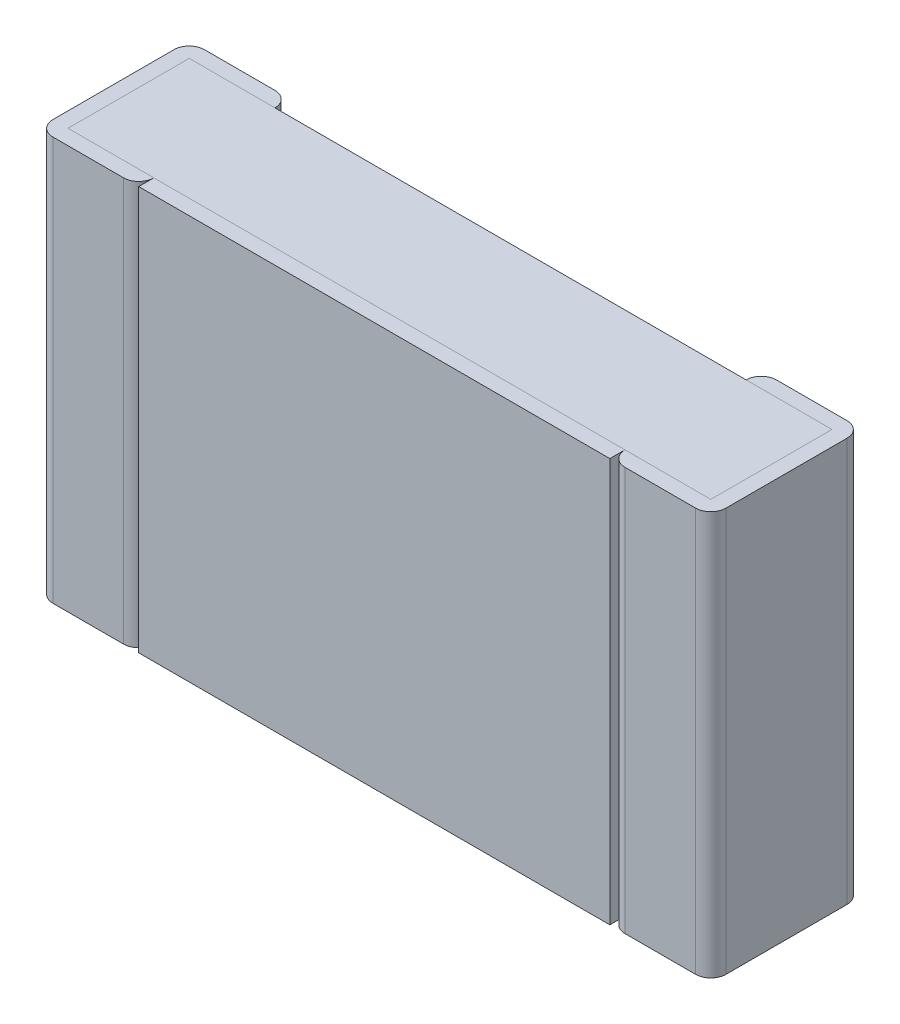
ISO-10303-21;
HEADER;
FILE_DESCRIPTION(('STEP AP214'),'2;1');
FILE_NAME('part.step','',(''),(''),'','','');
FILE_SCHEMA(('AUTOMOTIVE_DESIGN { 1 0 10303 214 1 1 1 1 }'));
ENDSEC;
DATA;
#1=APPLICATION_CONTEXT('core data for automotive mechanical design processes');
#2=APPLICATION_PROTOCOL_DEFINITION('international standard','automotive_design',2000,#1);
#3=PRODUCT_CONTEXT('',#1,'mechanical');
#4=PRODUCT('Part','Part','',(#3));
#5=PRODUCT_RELATED_PRODUCT_CATEGORY('part','',(#4));
#6=PRODUCT_DEFINITION_FORMATION('','',#4);
#7=PRODUCT_DEFINITION_CONTEXT('part definition',#1,'design');
#8=PRODUCT_DEFINITION('design','',#6,#7);
#9=PRODUCT_DEFINITION_SHAPE('','',#8);
#10=(LENGTH_UNIT() NAMED_UNIT(*) SI_UNIT(.MILLI.,.METRE.));
#11=(NAMED_UNIT(*) PLANE_ANGLE_UNIT() SI_UNIT($,.RADIAN.));
#12=(NAMED_UNIT(*) SI_UNIT($,.STERADIAN.) SOLID_ANGLE_UNIT());
#13=UNCERTAINTY_MEASURE_WITH_UNIT(LENGTH_MEASURE(1.E-05),#10,'distance_accuracy_value','');
#14=(GEOMETRIC_REPRESENTATION_CONTEXT(3) GLOBAL_UNCERTAINTY_ASSIGNED_CONTEXT((#13)) GLOBAL_UNIT_ASSIGNED_CONTEXT((#10,
#11,#12)) REPRESENTATION_CONTEXT('',''));
#15=CARTESIAN_POINT('',(0.,0.,0.));
#16=DIRECTION('',(0.,0.,1.));
#17=DIRECTION('',(1.,0.,0.));
#18=AXIS2_PLACEMENT_3D('',#15,#16,#17);
#19=CARTESIAN_POINT('',(-1.,-0.6,0.));
#20=DIRECTION('',(1.,0.,0.));
#21=DIRECTION('',(0.,1.,0.));
#22=AXIS2_PLACEMENT_3D('',#19,#20,#21);
#23=PLANE('',#22);
#24=DIRECTION('',(0.,1.,0.));
#25=VECTOR('',#24,1.);
#26=CARTESIAN_POINT('',(-1.,-0.6,0.405));
#27=LINE('',#26,#25);
#28=CARTESIAN_POINT('',(-1.,-0.6,0.405));
#29=VERTEX_POINT('',#28);
#30=CARTESIAN_POINT('',(-1.,0.6,0.405));
#31=VERTEX_POINT('',#30);
#32=EDGE_CURVE('E11',#29,#31,#27,.T.);
#33=ORIENTED_EDGE('',*,*,#32,.T.);
#34=DIRECTION('',(0.,0.,1.));
#35=VECTOR('',#34,1.);
#36=CARTESIAN_POINT('',(-1.,0.6,0.));
#37=LINE('',#36,#35);
#38=CARTESIAN_POINT('',(-1.,0.6,0.045));
#39=VERTEX_POINT('',#38);
#40=EDGE_CURVE('E41',#39,#31,#37,.T.);
#41=ORIENTED_EDGE('',*,*,#40,.F.);
#42=DIRECTION('',(0.,1.,0.));
#43=VECTOR('',#42,1.);
#44=CARTESIAN_POINT('',(-1.,-0.6,0.045));
#45=LINE('',#44,#43);
#46=CARTESIAN_POINT('',(-1.,-0.6,0.045));
#47=VERTEX_POINT('',#46);
#48=EDGE_CURVE('E310',#47,#39,#45,.T.);
#49=ORIENTED_EDGE('',*,*,#48,.F.);
#50=DIRECTION('',(0.,0.,1.));
#51=VECTOR('',#50,1.);
#52=CARTESIAN_POINT('',(-1.,-0.6,0.));
#53=LINE('',#52,#51);
#54=EDGE_CURVE('E27',#47,#29,#53,.T.);
#55=ORIENTED_EDGE('',*,*,#54,.T.);
#56=EDGE_LOOP('',(#33,#41,#49,#55));
#57=FACE_BOUND('',#56,.T.);
#58=ADVANCED_FACE('F16',(#57),#23,.F.);
#59=CARTESIAN_POINT('',(-1.,-0.6,0.));
#60=DIRECTION('',(0.,1.,0.));
#61=DIRECTION('',(1.,0.,0.));
#62=AXIS2_PLACEMENT_3D('',#59,#60,#61);
#63=PLANE('',#62);
#64=CARTESIAN_POINT('',(-0.745,-0.6,0.045));
#65=DIRECTION('',(0.,1.,0.));
#66=DIRECTION('',(0.,0.,1.));
#67=AXIS2_PLACEMENT_3D('',#64,#65,#66);
#68=CIRCLE('',#67,0.045);
#69=CARTESIAN_POINT('',(-0.7,-0.6,0.045));
#70=VERTEX_POINT('',#69);
#71=CARTESIAN_POINT('',(-0.745,-0.6,0.));
#72=VERTEX_POINT('',#71);
#73=EDGE_CURVE('E342',#70,#72,#68,.T.);
#74=ORIENTED_EDGE('',*,*,#73,.F.);
#75=DIRECTION('',(1.,0.,0.));
#76=VECTOR('',#75,1.);
#77=CARTESIAN_POINT('',(-0.955,-0.6,0.045));
#78=LINE('',#77,#76);
#79=CARTESIAN_POINT('',(-0.955,-0.6,0.045));
#80=VERTEX_POINT('',#79);
#81=EDGE_CURVE('E279',#80,#70,#78,.T.);
#82=ORIENTED_EDGE('',*,*,#81,.F.);
#83=DIRECTION('',(0.,0.,1.));
#84=VECTOR('',#83,1.);
#85=CARTESIAN_POINT('',(-0.955,-0.6,0.045));
#86=LINE('',#85,#84);
#87=CARTESIAN_POINT('',(-0.955,-0.6,0.405));
#88=VERTEX_POINT('',#87);
#89=EDGE_CURVE('E319',#80,#88,#86,.T.);
#90=ORIENTED_EDGE('',*,*,#89,.T.);
#91=DIRECTION('',(1.,0.,0.));
#92=VECTOR('',#91,1.);
#93=CARTESIAN_POINT('',(-0.955,-0.6,0.405));
#94=LINE('',#93,#92);
#95=CARTESIAN_POINT('',(-0.7,-0.6,0.405));
#96=VERTEX_POINT('',#95);
#97=EDGE_CURVE('E381',#88,#96,#94,.T.);
#98=ORIENTED_EDGE('',*,*,#97,.T.);
#99=CARTESIAN_POINT('',(-0.745,-0.6,0.405));
#100=DIRECTION('',(0.,-1.,0.));
#101=DIRECTION('',(0.,0.,1.));
#102=AXIS2_PLACEMENT_3D('',#99,#100,#101);
#103=CIRCLE('',#102,0.045);
#104=CARTESIAN_POINT('',(-0.745,-0.6,0.45));
#105=VERTEX_POINT('',#104);
#106=EDGE_CURVE('E403',#96,#105,#103,.T.);
#107=ORIENTED_EDGE('',*,*,#106,.T.);
#108=DIRECTION('',(1.,0.,0.));
#109=VECTOR('',#108,1.);
#110=CARTESIAN_POINT('',(-1.,-0.6,0.45));
#111=LINE('',#110,#109);
#112=CARTESIAN_POINT('',(-0.955,-0.6,0.45));
#113=VERTEX_POINT('',#112);
#114=EDGE_CURVE('E271',#113,#105,#111,.T.);
#115=ORIENTED_EDGE('',*,*,#114,.F.);
#116=CARTESIAN_POINT('',(-0.955,-0.6,0.405));
#117=DIRECTION('',(0.,1.,0.));
#118=DIRECTION('',(0.,0.,1.));
#119=AXIS2_PLACEMENT_3D('',#116,#117,#118);
#120=CIRCLE('',#119,0.045);
#121=EDGE_CURVE('E311',#29,#113,#120,.T.);
#122=ORIENTED_EDGE('',*,*,#121,.F.);
#123=ORIENTED_EDGE('',*,*,#54,.F.);
#124=CARTESIAN_POINT('',(-0.955,-0.6,0.045));
#125=DIRECTION('',(0.,-1.,0.));
#126=DIRECTION('',(0.,0.,1.));
#127=AXIS2_PLACEMENT_3D('',#124,#125,#126);
#128=CIRCLE('',#127,0.045);
#129=CARTESIAN_POINT('',(-0.955,-0.6,0.));
#130=VERTEX_POINT('',#129);
#131=EDGE_CURVE('E351',#47,#130,#128,.T.);
#132=ORIENTED_EDGE('',*,*,#131,.T.);
#133=DIRECTION('',(1.,0.,0.));
#134=VECTOR('',#133,1.);
#135=CARTESIAN_POINT('',(-1.,-0.6,0.));
#136=LINE('',#135,#134);
#137=EDGE_CURVE('E347',#130,#72,#136,.T.);
#138=ORIENTED_EDGE('',*,*,#137,.T.);
#139=EDGE_LOOP('',(#74,#82,#90,#98,#107,#115,#122,#123,#132,#138));
#140=FACE_BOUND('',#139,.T.);
#141=ADVANCED_FACE('F489',(#140),#63,.F.);
#142=CARTESIAN_POINT('',(-0.955,-0.6,0.045));
#143=DIRECTION('',(0.,1.,0.));
#144=DIRECTION('',(-1.,0.,0.));
#145=AXIS2_PLACEMENT_3D('',#142,#143,#144);
#146=CYLINDRICAL_SURFACE('',#145,0.045);
#147=ORIENTED_EDGE('',*,*,#48,.T.);
#148=CARTESIAN_POINT('',(-0.955,0.6,0.045));
#149=DIRECTION('',(0.,-1.,0.));
#150=DIRECTION('',(0.,0.,1.));
#151=AXIS2_PLACEMENT_3D('',#148,#149,#150);
#152=CIRCLE('',#151,0.045);
#153=CARTESIAN_POINT('',(-0.955,0.6,0.));
#154=VERTEX_POINT('',#153);
#155=EDGE_CURVE('E306',#39,#154,#152,.T.);
#156=ORIENTED_EDGE('',*,*,#155,.T.);
#157=DIRECTION('',(0.,1.,0.));
#158=VECTOR('',#157,1.);
#159=CARTESIAN_POINT('',(-0.955,-0.6,0.));
#160=LINE('',#159,#158);
#161=EDGE_CURVE('E341',#130,#154,#160,.T.);
#162=ORIENTED_EDGE('',*,*,#161,.F.);
#163=ORIENTED_EDGE('',*,*,#131,.F.);
#164=EDGE_LOOP('',(#147,#156,#162,#163));
#165=FACE_BOUND('',#164,.T.);
#166=ADVANCED_FACE('F474',(#165),#146,.T.);
#167=CARTESIAN_POINT('',(-0.955,-0.6,0.405));
#168=DIRECTION('',(0.,1.,0.));
#169=DIRECTION('',(-1.,0.,0.));
#170=AXIS2_PLACEMENT_3D('',#167,#168,#169);
#171=CYLINDRICAL_SURFACE('',#170,0.045);
#172=ORIENTED_EDGE('',*,*,#121,.T.);
#173=DIRECTION('',(0.,1.,0.));
#174=VECTOR('',#173,1.);
#175=CARTESIAN_POINT('',(-0.955,-0.6,0.45));
#176=LINE('',#175,#174);
#177=CARTESIAN_POINT('',(-0.955,0.6,0.45));
#178=VERTEX_POINT('',#177);
#179=EDGE_CURVE('E376',#113,#178,#176,.T.);
#180=ORIENTED_EDGE('',*,*,#179,.T.);
#181=CARTESIAN_POINT('',(-0.955,0.6,0.405));
#182=DIRECTION('',(0.,1.,0.));
#183=DIRECTION('',(0.,0.,1.));
#184=AXIS2_PLACEMENT_3D('',#181,#182,#183);
#185=CIRCLE('',#184,0.045);
#186=EDGE_CURVE('E262',#31,#178,#185,.T.);
#187=ORIENTED_EDGE('',*,*,#186,.F.);
#188=ORIENTED_EDGE('',*,*,#32,.F.);
#189=EDGE_LOOP('',(#172,#180,#187,#188));
#190=FACE_BOUND('',#189,.T.);
#191=ADVANCED_FACE('F495',(#190),#171,.T.);
#192=CARTESIAN_POINT('',(-1.,0.6,0.));
#193=DIRECTION('',(0.,1.,0.));
#194=DIRECTION('',(1.,0.,0.));
#195=AXIS2_PLACEMENT_3D('',#192,#193,#194);
#196=PLANE('',#195);
#197=DIRECTION('',(1.,0.,0.));
#198=VECTOR('',#197,1.);
#199=CARTESIAN_POINT('',(-1.,0.6,0.));
#200=LINE('',#199,#198);
#201=CARTESIAN_POINT('',(-0.745,0.6,0.));
#202=VERTEX_POINT('',#201);
#203=EDGE_CURVE('E338',#154,#202,#200,.T.);
#204=ORIENTED_EDGE('',*,*,#203,.F.);
#205=ORIENTED_EDGE('',*,*,#155,.F.);
#206=ORIENTED_EDGE('',*,*,#40,.T.);
#207=ORIENTED_EDGE('',*,*,#186,.T.);
#208=DIRECTION('',(1.,0.,0.));
#209=VECTOR('',#208,1.);
#210=CARTESIAN_POINT('',(-1.,0.6,0.45));
#211=LINE('',#210,#209);
#212=CARTESIAN_POINT('',(-0.745,0.6,0.45));
#213=VERTEX_POINT('',#212);
#214=EDGE_CURVE('E258',#178,#213,#211,.T.);
#215=ORIENTED_EDGE('',*,*,#214,.T.);
#216=CARTESIAN_POINT('',(-0.745,0.6,0.405));
#217=DIRECTION('',(0.,-1.,0.));
#218=DIRECTION('',(0.,0.,1.));
#219=AXIS2_PLACEMENT_3D('',#216,#217,#218);
#220=CIRCLE('',#219,0.045);
#221=CARTESIAN_POINT('',(-0.7,0.6,0.405));
#222=VERTEX_POINT('',#221);
#223=EDGE_CURVE('E245',#222,#213,#220,.T.);
#224=ORIENTED_EDGE('',*,*,#223,.F.);
#225=DIRECTION('',(1.,0.,0.));
#226=VECTOR('',#225,1.);
#227=CARTESIAN_POINT('',(-0.955,0.6,0.405));
#228=LINE('',#227,#226);
#229=CARTESIAN_POINT('',(-0.955,0.6,0.405));
#230=VERTEX_POINT('',#229);
#231=EDGE_CURVE('E292',#230,#222,#228,.T.);
#232=ORIENTED_EDGE('',*,*,#231,.F.);
#233=DIRECTION('',(0.,0.,1.));
#234=VECTOR('',#233,1.);
#235=CARTESIAN_POINT('',(-0.955,0.6,0.045));
#236=LINE('',#235,#234);
#237=CARTESIAN_POINT('',(-0.955,0.6,0.045));
#238=VERTEX_POINT('',#237);
#239=EDGE_CURVE('E255',#238,#230,#236,.T.);
#240=ORIENTED_EDGE('',*,*,#239,.F.);
#241=DIRECTION('',(1.,0.,0.));
#242=VECTOR('',#241,1.);
#243=CARTESIAN_POINT('',(-0.955,0.6,0.045));
#244=LINE('',#243,#242);
#245=CARTESIAN_POINT('',(-0.7,0.6,0.045));
#246=VERTEX_POINT('',#245);
#247=EDGE_CURVE('E267',#238,#246,#244,.T.);
#248=ORIENTED_EDGE('',*,*,#247,.T.);
#249=CARTESIAN_POINT('',(-0.745,0.6,0.045));
#250=DIRECTION('',(0.,1.,0.));
#251=DIRECTION('',(0.,0.,1.));
#252=AXIS2_PLACEMENT_3D('',#249,#250,#251);
#253=CIRCLE('',#252,0.045);
#254=EDGE_CURVE('E346',#246,#202,#253,.T.);
#255=ORIENTED_EDGE('',*,*,#254,.T.);
#256=EDGE_LOOP('',(#204,#205,#206,#207,#215,#224,#232,#240,#248,#255));
#257=FACE_BOUND('',#256,.T.);
#258=ADVANCED_FACE('F260',(#257),#196,.T.);
#259=CARTESIAN_POINT('',(-1.,-0.6,0.));
#260=DIRECTION('',(0.,0.,1.));
#261=DIRECTION('',(1.,0.,0.));
#262=AXIS2_PLACEMENT_3D('',#259,#260,#261);
#263=PLANE('',#262);
#264=DIRECTION('',(0.,1.,0.));
#265=VECTOR('',#264,1.);
#266=CARTESIAN_POINT('',(-0.745,-0.6,0.));
#267=LINE('',#266,#265);
#268=EDGE_CURVE('E372',#72,#202,#267,.T.);
#269=ORIENTED_EDGE('',*,*,#268,.F.);
#270=ORIENTED_EDGE('',*,*,#137,.F.);
#271=ORIENTED_EDGE('',*,*,#161,.T.);
#272=ORIENTED_EDGE('',*,*,#203,.T.);
#273=EDGE_LOOP('',(#269,#270,#271,#272));
#274=FACE_BOUND('',#273,.T.);
#275=ADVANCED_FACE('F471',(#274),#263,.F.);
#276=CARTESIAN_POINT('',(-0.745,-0.6,0.045));
#277=DIRECTION('',(0.,1.,0.));
#278=DIRECTION('',(1.,0.,0.));
#279=AXIS2_PLACEMENT_3D('',#276,#277,#278);
#280=CYLINDRICAL_SURFACE('',#279,0.045);
#281=ORIENTED_EDGE('',*,*,#73,.T.);
#282=ORIENTED_EDGE('',*,*,#268,.T.);
#283=ORIENTED_EDGE('',*,*,#254,.F.);
#284=DIRECTION('',(0.,1.,0.));
#285=VECTOR('',#284,1.);
#286=CARTESIAN_POINT('',(-0.7,-0.6,0.045));
#287=LINE('',#286,#285);
#288=EDGE_CURVE('E361',#70,#246,#287,.T.);
#289=ORIENTED_EDGE('',*,*,#288,.F.);
#290=EDGE_LOOP('',(#281,#282,#283,#289));
#291=FACE_BOUND('',#290,.T.);
#292=ADVANCED_FACE('F480',(#291),#280,.T.);
#293=CARTESIAN_POINT('',(-0.955,-0.6,0.045));
#294=DIRECTION('',(0.,1.,0.));
#295=DIRECTION('',(1.,0.,0.));
#296=AXIS2_PLACEMENT_3D('',#293,#294,#295);
#297=PLANE('',#296);
#298=DIRECTION('',(1.,0.,0.));
#299=VECTOR('',#298,1.);
#300=CARTESIAN_POINT('',(-0.955,-0.6,0.045));
#301=LINE('',#300,#299);
#302=CARTESIAN_POINT('',(0.7,-0.6,0.045));
#303=VERTEX_POINT('',#302);
#304=EDGE_CURVE('E323',#70,#303,#301,.T.);
#305=ORIENTED_EDGE('',*,*,#304,.T.);
#306=DIRECTION('',(1.,0.,0.));
#307=VECTOR('',#306,1.);
#308=CARTESIAN_POINT('',(-0.955,-0.6,0.045));
#309=LINE('',#308,#307);
#310=CARTESIAN_POINT('',(0.955,-0.6,0.045));
#311=VERTEX_POINT('',#310);
#312=EDGE_CURVE('E320',#303,#311,#309,.T.);
#313=ORIENTED_EDGE('',*,*,#312,.T.);
#314=DIRECTION('',(0.,0.,1.));
#315=VECTOR('',#314,1.);
#316=CARTESIAN_POINT('',(0.955,-0.6,0.045));
#317=LINE('',#316,#315);
#318=CARTESIAN_POINT('',(0.955,-0.6,0.405));
#319=VERTEX_POINT('',#318);
#320=EDGE_CURVE('E173',#311,#319,#317,.T.);
#321=ORIENTED_EDGE('',*,*,#320,.T.);
#322=DIRECTION('',(1.,0.,0.));
#323=VECTOR('',#322,1.);
#324=CARTESIAN_POINT('',(-0.955,-0.6,0.405));
#325=LINE('',#324,#323);
#326=CARTESIAN_POINT('',(0.7,-0.6,0.405));
#327=VERTEX_POINT('',#326);
#328=EDGE_CURVE('E437',#327,#319,#325,.T.);
#329=ORIENTED_EDGE('',*,*,#328,.F.);
#330=DIRECTION('',(1.,0.,0.));
#331=VECTOR('',#330,1.);
#332=CARTESIAN_POINT('',(-0.7,-0.6,0.405));
#333=LINE('',#332,#331);
#334=EDGE_CURVE('E397',#96,#327,#333,.T.);
#335=ORIENTED_EDGE('',*,*,#334,.F.);
#336=ORIENTED_EDGE('',*,*,#97,.F.);
#337=ORIENTED_EDGE('',*,*,#89,.F.);
#338=ORIENTED_EDGE('',*,*,#81,.T.);
#339=EDGE_LOOP('',(#305,#313,#321,#329,#335,#336,#337,#338));
#340=FACE_BOUND('',#339,.T.);
#341=ADVANCED_FACE('F551',(#340),#297,.F.);
#342=CARTESIAN_POINT('',(-1.,-0.6,0.45));
#343=DIRECTION('',(0.,0.,1.));
#344=DIRECTION('',(1.,0.,0.));
#345=AXIS2_PLACEMENT_3D('',#342,#343,#344);
#346=PLANE('',#345);
#347=ORIENTED_EDGE('',*,*,#214,.F.);
#348=ORIENTED_EDGE('',*,*,#179,.F.);
#349=ORIENTED_EDGE('',*,*,#114,.T.);
#350=DIRECTION('',(0.,1.,0.));
#351=VECTOR('',#350,1.);
#352=CARTESIAN_POINT('',(-0.745,-0.6,0.45));
#353=LINE('',#352,#351);
#354=EDGE_CURVE('E250',#105,#213,#353,.T.);
#355=ORIENTED_EDGE('',*,*,#354,.T.);
#356=EDGE_LOOP('',(#347,#348,#349,#355));
#357=FACE_BOUND('',#356,.T.);
#358=ADVANCED_FACE('F270',(#357),#346,.T.);
#359=CARTESIAN_POINT('',(-0.745,-0.6,0.405));
#360=DIRECTION('',(0.,1.,0.));
#361=DIRECTION('',(1.,0.,0.));
#362=AXIS2_PLACEMENT_3D('',#359,#360,#361);
#363=CYLINDRICAL_SURFACE('',#362,0.045);
#364=DIRECTION('',(0.,1.,0.));
#365=VECTOR('',#364,1.);
#366=CARTESIAN_POINT('',(-0.7,-0.6,0.405));
#367=LINE('',#366,#365);
#368=EDGE_CURVE('E252',#96,#222,#367,.T.);
#369=ORIENTED_EDGE('',*,*,#368,.T.);
#370=ORIENTED_EDGE('',*,*,#223,.T.);
#371=ORIENTED_EDGE('',*,*,#354,.F.);
#372=ORIENTED_EDGE('',*,*,#106,.F.);
#373=EDGE_LOOP('',(#369,#370,#371,#372));
#374=FACE_BOUND('',#373,.T.);
#375=ADVANCED_FACE('F247',(#374),#363,.T.);
#376=CARTESIAN_POINT('',(-0.955,0.6,0.045));
#377=DIRECTION('',(0.,1.,0.));
#378=DIRECTION('',(1.,0.,0.));
#379=AXIS2_PLACEMENT_3D('',#376,#377,#378);
#380=PLANE('',#379);
#381=ORIENTED_EDGE('',*,*,#247,.F.);
#382=ORIENTED_EDGE('',*,*,#239,.T.);
#383=ORIENTED_EDGE('',*,*,#231,.T.);
#384=DIRECTION('',(1.,0.,0.));
#385=VECTOR('',#384,1.);
#386=CARTESIAN_POINT('',(-0.7,0.6,0.405));
#387=LINE('',#386,#385);
#388=CARTESIAN_POINT('',(0.7,0.6,0.405));
#389=VERTEX_POINT('',#388);
#390=EDGE_CURVE('E296',#222,#389,#387,.T.);
#391=ORIENTED_EDGE('',*,*,#390,.T.);
#392=DIRECTION('',(1.,0.,0.));
#393=VECTOR('',#392,1.);
#394=CARTESIAN_POINT('',(-0.955,0.6,0.405));
#395=LINE('',#394,#393);
#396=CARTESIAN_POINT('',(0.955,0.6,0.405));
#397=VERTEX_POINT('',#396);
#398=EDGE_CURVE('E398',#389,#397,#395,.T.);
#399=ORIENTED_EDGE('',*,*,#398,.T.);
#400=DIRECTION('',(0.,0.,1.));
#401=VECTOR('',#400,1.);
#402=CARTESIAN_POINT('',(0.955,0.6,0.045));
#403=LINE('',#402,#401);
#404=CARTESIAN_POINT('',(0.955,0.6,0.045));
#405=VERTEX_POINT('',#404);
#406=EDGE_CURVE('E291',#405,#397,#403,.T.);
#407=ORIENTED_EDGE('',*,*,#406,.F.);
#408=DIRECTION('',(1.,0.,0.));
#409=VECTOR('',#408,1.);
#410=CARTESIAN_POINT('',(-0.955,0.6,0.045));
#411=LINE('',#410,#409);
#412=CARTESIAN_POINT('',(0.7,0.6,0.045));
#413=VERTEX_POINT('',#412);
#414=EDGE_CURVE('E287',#413,#405,#411,.T.);
#415=ORIENTED_EDGE('',*,*,#414,.F.);
#416=DIRECTION('',(1.,0.,0.));
#417=VECTOR('',#416,1.);
#418=CARTESIAN_POINT('',(-0.955,0.6,0.045));
#419=LINE('',#418,#417);
#420=EDGE_CURVE('E364',#246,#413,#419,.T.);
#421=ORIENTED_EDGE('',*,*,#420,.F.);
#422=EDGE_LOOP('',(#381,#382,#383,#391,#399,#407,#415,#421));
#423=FACE_BOUND('',#422,.T.);
#424=ADVANCED_FACE('F523',(#423),#380,.T.);
#425=CARTESIAN_POINT('',(-0.955,-0.6,0.045));
#426=DIRECTION('',(0.,0.,1.));
#427=DIRECTION('',(1.,0.,0.));
#428=AXIS2_PLACEMENT_3D('',#425,#426,#427);
#429=PLANE('',#428);
#430=ORIENTED_EDGE('',*,*,#420,.T.);
#431=DIRECTION('',(0.,1.,0.));
#432=VECTOR('',#431,1.);
#433=CARTESIAN_POINT('',(0.7,-0.6,0.045));
#434=LINE('',#433,#432);
#435=EDGE_CURVE('E312',#303,#413,#434,.T.);
#436=ORIENTED_EDGE('',*,*,#435,.F.);
#437=ORIENTED_EDGE('',*,*,#304,.F.);
#438=ORIENTED_EDGE('',*,*,#288,.T.);
#439=EDGE_LOOP('',(#430,#436,#437,#438));
#440=FACE_BOUND('',#439,.T.);
#441=ADVANCED_FACE('F520',(#440),#429,.F.);
#442=CARTESIAN_POINT('',(0.7,-0.6,0.));
#443=DIRECTION('',(0.,1.,0.));
#444=DIRECTION('',(1.,0.,0.));
#445=AXIS2_PLACEMENT_3D('',#442,#443,#444);
#446=PLANE('',#445);
#447=CARTESIAN_POINT('',(0.955,-0.6,0.045));
#448=DIRECTION('',(0.,1.,0.));
#449=DIRECTION('',(0.,0.,1.));
#450=AXIS2_PLACEMENT_3D('',#447,#448,#449);
#451=CIRCLE('',#450,0.045);
#452=CARTESIAN_POINT('',(1.,-0.6,0.045));
#453=VERTEX_POINT('',#452);
#454=CARTESIAN_POINT('',(0.955,-0.6,0.));
#455=VERTEX_POINT('',#454);
#456=EDGE_CURVE('E419',#453,#455,#451,.T.);
#457=ORIENTED_EDGE('',*,*,#456,.F.);
#458=DIRECTION('',(0.,0.,1.));
#459=VECTOR('',#458,1.);
#460=CARTESIAN_POINT('',(1.,-0.6,0.));
#461=LINE('',#460,#459);
#462=CARTESIAN_POINT('',(1.,-0.6,0.405));
#463=VERTEX_POINT('',#462);
#464=EDGE_CURVE('E365',#453,#463,#461,.T.);
#465=ORIENTED_EDGE('',*,*,#464,.T.);
#466=CARTESIAN_POINT('',(0.955,-0.6,0.405));
#467=DIRECTION('',(0.,-1.,0.));
#468=DIRECTION('',(0.,0.,1.));
#469=AXIS2_PLACEMENT_3D('',#466,#467,#468);
#470=CIRCLE('',#469,0.045);
#471=CARTESIAN_POINT('',(0.955,-0.6,0.45));
#472=VERTEX_POINT('',#471);
#473=EDGE_CURVE('E429',#463,#472,#470,.T.);
#474=ORIENTED_EDGE('',*,*,#473,.T.);
#475=DIRECTION('',(1.,0.,0.));
#476=VECTOR('',#475,1.);
#477=CARTESIAN_POINT('',(0.7,-0.6,0.45));
#478=LINE('',#477,#476);
#479=CARTESIAN_POINT('',(0.745,-0.6,0.45));
#480=VERTEX_POINT('',#479);
#481=EDGE_CURVE('E357',#480,#472,#478,.T.);
#482=ORIENTED_EDGE('',*,*,#481,.F.);
#483=CARTESIAN_POINT('',(0.745,-0.6,0.405));
#484=DIRECTION('',(0.,1.,0.));
#485=DIRECTION('',(0.,0.,1.));
#486=AXIS2_PLACEMENT_3D('',#483,#484,#485);
#487=CIRCLE('',#486,0.045);
#488=EDGE_CURVE('E185',#327,#480,#487,.T.);
#489=ORIENTED_EDGE('',*,*,#488,.F.);
#490=ORIENTED_EDGE('',*,*,#328,.T.);
#491=ORIENTED_EDGE('',*,*,#320,.F.);
#492=ORIENTED_EDGE('',*,*,#312,.F.);
#493=CARTESIAN_POINT('',(0.745,-0.6,0.045));
#494=DIRECTION('',(0.,-1.,0.));
#495=DIRECTION('',(0.,0.,1.));
#496=AXIS2_PLACEMENT_3D('',#493,#494,#495);
#497=CIRCLE('',#496,0.045);
#498=CARTESIAN_POINT('',(0.745,-0.6,0.));
#499=VERTEX_POINT('',#498);
#500=EDGE_CURVE('E433',#303,#499,#497,.T.);
#501=ORIENTED_EDGE('',*,*,#500,.T.);
#502=DIRECTION('',(1.,0.,0.));
#503=VECTOR('',#502,1.);
#504=CARTESIAN_POINT('',(0.7,-0.6,0.));
#505=LINE('',#504,#503);
#506=EDGE_CURVE('E396',#499,#455,#505,.T.);
#507=ORIENTED_EDGE('',*,*,#506,.T.);
#508=EDGE_LOOP('',(#457,#465,#474,#482,#489,#490,#491,#492,#501,#507));
#509=FACE_BOUND('',#508,.T.);
#510=ADVANCED_FACE('F517',(#509),#446,.F.);
#511=CARTESIAN_POINT('',(-0.7,-0.6,0.405));
#512=DIRECTION('',(0.,1.,0.));
#513=DIRECTION('',(1.,0.,0.));
#514=AXIS2_PLACEMENT_3D('',#511,#512,#513);
#515=PLANE('',#514);
#516=DIRECTION('',(0.,0.,1.));
#517=VECTOR('',#516,1.);
#518=CARTESIAN_POINT('',(0.7,-0.6,0.405));
#519=LINE('',#518,#517);
#520=CARTESIAN_POINT('',(0.7,-0.6,0.45));
#521=VERTEX_POINT('',#520);
#522=EDGE_CURVE('E392',#327,#521,#519,.T.);
#523=ORIENTED_EDGE('',*,*,#522,.T.);
#524=DIRECTION('',(1.,0.,0.));
#525=VECTOR('',#524,1.);
#526=CARTESIAN_POINT('',(-0.7,-0.6,0.45));
#527=LINE('',#526,#525);
#528=CARTESIAN_POINT('',(-0.7,-0.6,0.45));
#529=VERTEX_POINT('',#528);
#530=EDGE_CURVE('E20',#529,#521,#527,.T.);
#531=ORIENTED_EDGE('',*,*,#530,.F.);
#532=DIRECTION('',(0.,0.,1.));
#533=VECTOR('',#532,1.);
#534=CARTESIAN_POINT('',(-0.7,-0.6,0.405));
#535=LINE('',#534,#533);
#536=EDGE_CURVE('E290',#96,#529,#535,.T.);
#537=ORIENTED_EDGE('',*,*,#536,.F.);
#538=ORIENTED_EDGE('',*,*,#334,.T.);
#539=EDGE_LOOP('',(#523,#531,#537,#538));
#540=FACE_BOUND('',#539,.T.);
#541=ADVANCED_FACE('F18',(#540),#515,.F.);
#542=CARTESIAN_POINT('',(-0.7,-0.6,0.405));
#543=DIRECTION('',(1.,0.,0.));
#544=DIRECTION('',(0.,1.,0.));
#545=AXIS2_PLACEMENT_3D('',#542,#543,#544);
#546=PLANE('',#545);
#547=DIRECTION('',(0.,1.,0.));
#548=VECTOR('',#547,1.);
#549=CARTESIAN_POINT('',(-0.7,-0.6,0.45));
#550=LINE('',#549,#548);
#551=CARTESIAN_POINT('',(-0.7,0.6,0.45));
#552=VERTEX_POINT('',#551);
#553=EDGE_CURVE('E440',#529,#552,#550,.T.);
#554=ORIENTED_EDGE('',*,*,#553,.T.);
#555=DIRECTION('',(0.,0.,1.));
#556=VECTOR('',#555,1.);
#557=CARTESIAN_POINT('',(-0.7,0.6,0.405));
#558=LINE('',#557,#556);
#559=EDGE_CURVE('E354',#222,#552,#558,.T.);
#560=ORIENTED_EDGE('',*,*,#559,.F.);
#561=ORIENTED_EDGE('',*,*,#368,.F.);
#562=ORIENTED_EDGE('',*,*,#536,.T.);
#563=EDGE_LOOP('',(#554,#560,#561,#562));
#564=FACE_BOUND('',#563,.T.);
#565=ADVANCED_FACE('F547',(#564),#546,.F.);
#566=CARTESIAN_POINT('',(0.7,0.6,0.));
#567=DIRECTION('',(0.,1.,0.));
#568=DIRECTION('',(1.,0.,0.));
#569=AXIS2_PLACEMENT_3D('',#566,#567,#568);
#570=PLANE('',#569);
#571=DIRECTION('',(1.,0.,0.));
#572=VECTOR('',#571,1.);
#573=CARTESIAN_POINT('',(0.7,0.6,0.));
#574=LINE('',#573,#572);
#575=CARTESIAN_POINT('',(0.745,0.6,0.));
#576=VERTEX_POINT('',#575);
#577=CARTESIAN_POINT('',(0.955,0.6,0.));
#578=VERTEX_POINT('',#577);
#579=EDGE_CURVE('E137',#576,#578,#574,.T.);
#580=ORIENTED_EDGE('',*,*,#579,.F.);
#581=CARTESIAN_POINT('',(0.745,0.6,0.045));
#582=DIRECTION('',(0.,-1.,0.));
#583=DIRECTION('',(0.,0.,1.));
#584=AXIS2_PLACEMENT_3D('',#581,#582,#583);
#585=CIRCLE('',#584,0.045);
#586=EDGE_CURVE('E316',#413,#576,#585,.T.);
#587=ORIENTED_EDGE('',*,*,#586,.F.);
#588=ORIENTED_EDGE('',*,*,#414,.T.);
#589=ORIENTED_EDGE('',*,*,#406,.T.);
#590=ORIENTED_EDGE('',*,*,#398,.F.);
#591=CARTESIAN_POINT('',(0.745,0.6,0.405));
#592=DIRECTION('',(0.,1.,0.));
#593=DIRECTION('',(0.,0.,1.));
#594=AXIS2_PLACEMENT_3D('',#591,#592,#593);
#595=CIRCLE('',#594,0.045);
#596=CARTESIAN_POINT('',(0.745,0.6,0.45));
#597=VERTEX_POINT('',#596);
#598=EDGE_CURVE('E327',#389,#597,#595,.T.);
#599=ORIENTED_EDGE('',*,*,#598,.T.);
#600=DIRECTION('',(1.,0.,0.));
#601=VECTOR('',#600,1.);
#602=CARTESIAN_POINT('',(0.7,0.6,0.45));
#603=LINE('',#602,#601);
#604=CARTESIAN_POINT('',(0.955,0.6,0.45));
#605=VERTEX_POINT('',#604);
#606=EDGE_CURVE('E79',#597,#605,#603,.T.);
#607=ORIENTED_EDGE('',*,*,#606,.T.);
#608=CARTESIAN_POINT('',(0.955,0.6,0.405));
#609=DIRECTION('',(0.,-1.,0.));
#610=DIRECTION('',(0.,0.,1.));
#611=AXIS2_PLACEMENT_3D('',#608,#609,#610);
#612=CIRCLE('',#611,0.045);
#613=CARTESIAN_POINT('',(1.,0.6,0.405));
#614=VERTEX_POINT('',#613);
#615=EDGE_CURVE('E94',#614,#605,#612,.T.);
#616=ORIENTED_EDGE('',*,*,#615,.F.);
#617=DIRECTION('',(0.,0.,1.));
#618=VECTOR('',#617,1.);
#619=CARTESIAN_POINT('',(1.,0.6,0.));
#620=LINE('',#619,#618);
#621=CARTESIAN_POINT('',(1.,0.6,0.045));
#622=VERTEX_POINT('',#621);
#623=EDGE_CURVE('E300',#622,#614,#620,.T.);
#624=ORIENTED_EDGE('',*,*,#623,.F.);
#625=CARTESIAN_POINT('',(0.955,0.6,0.045));
#626=DIRECTION('',(0.,1.,0.));
#627=DIRECTION('',(0.,0.,1.));
#628=AXIS2_PLACEMENT_3D('',#625,#626,#627);
#629=CIRCLE('',#628,0.045);
#630=EDGE_CURVE('E337',#622,#578,#629,.T.);
#631=ORIENTED_EDGE('',*,*,#630,.T.);
#632=EDGE_LOOP('',(#580,#587,#588,#589,#590,#599,#607,#616,#624,#631));
#633=FACE_BOUND('',#632,.T.);
#634=ADVANCED_FACE('F544',(#633),#570,.T.);
#635=CARTESIAN_POINT('',(-0.7,0.6,0.405));
#636=DIRECTION('',(0.,1.,0.));
#637=DIRECTION('',(1.,0.,0.));
#638=AXIS2_PLACEMENT_3D('',#635,#636,#637);
#639=PLANE('',#638);
#640=ORIENTED_EDGE('',*,*,#390,.F.);
#641=ORIENTED_EDGE('',*,*,#559,.T.);
#642=DIRECTION('',(1.,0.,0.));
#643=VECTOR('',#642,1.);
#644=CARTESIAN_POINT('',(-0.7,0.6,0.45));
#645=LINE('',#644,#643);
#646=CARTESIAN_POINT('',(0.7,0.6,0.45));
#647=VERTEX_POINT('',#646);
#648=EDGE_CURVE('E315',#552,#647,#645,.T.);
#649=ORIENTED_EDGE('',*,*,#648,.T.);
#650=DIRECTION('',(0.,0.,1.));
#651=VECTOR('',#650,1.);
#652=CARTESIAN_POINT('',(0.7,0.6,0.405));
#653=LINE('',#652,#651);
#654=EDGE_CURVE('E127',#389,#647,#653,.T.);
#655=ORIENTED_EDGE('',*,*,#654,.F.);
#656=EDGE_LOOP('',(#640,#641,#649,#655));
#657=FACE_BOUND('',#656,.T.);
#658=ADVANCED_FACE('F538',(#657),#639,.T.);
#659=CARTESIAN_POINT('',(0.745,-0.6,0.045));
#660=DIRECTION('',(0.,1.,0.));
#661=DIRECTION('',(-1.,0.,0.));
#662=AXIS2_PLACEMENT_3D('',#659,#660,#661);
#663=CYLINDRICAL_SURFACE('',#662,0.045);
#664=ORIENTED_EDGE('',*,*,#435,.T.);
#665=ORIENTED_EDGE('',*,*,#586,.T.);
#666=DIRECTION('',(0.,1.,0.));
#667=VECTOR('',#666,1.);
#668=CARTESIAN_POINT('',(0.745,-0.6,0.));
#669=LINE('',#668,#667);
#670=EDGE_CURVE('E328',#499,#576,#669,.T.);
#671=ORIENTED_EDGE('',*,*,#670,.F.);
#672=ORIENTED_EDGE('',*,*,#500,.F.);
#673=EDGE_LOOP('',(#664,#665,#671,#672));
#674=FACE_BOUND('',#673,.T.);
#675=ADVANCED_FACE('F535',(#674),#663,.T.);
#676=CARTESIAN_POINT('',(0.7,-0.6,0.));
#677=DIRECTION('',(0.,0.,1.));
#678=DIRECTION('',(1.,0.,0.));
#679=AXIS2_PLACEMENT_3D('',#676,#677,#678);
#680=PLANE('',#679);
#681=DIRECTION('',(0.,1.,0.));
#682=VECTOR('',#681,1.);
#683=CARTESIAN_POINT('',(0.955,-0.6,0.));
#684=LINE('',#683,#682);
#685=EDGE_CURVE('E371',#455,#578,#684,.T.);
#686=ORIENTED_EDGE('',*,*,#685,.F.);
#687=ORIENTED_EDGE('',*,*,#506,.F.);
#688=ORIENTED_EDGE('',*,*,#670,.T.);
#689=ORIENTED_EDGE('',*,*,#579,.T.);
#690=EDGE_LOOP('',(#686,#687,#688,#689));
#691=FACE_BOUND('',#690,.T.);
#692=ADVANCED_FACE('F529',(#691),#680,.F.);
#693=CARTESIAN_POINT('',(0.955,-0.6,0.045));
#694=DIRECTION('',(0.,1.,0.));
#695=DIRECTION('',(1.,0.,0.));
#696=AXIS2_PLACEMENT_3D('',#693,#694,#695);
#697=CYLINDRICAL_SURFACE('',#696,0.045);
#698=ORIENTED_EDGE('',*,*,#456,.T.);
#699=ORIENTED_EDGE('',*,*,#685,.T.);
#700=ORIENTED_EDGE('',*,*,#630,.F.);
#701=DIRECTION('',(0.,1.,0.));
#702=VECTOR('',#701,1.);
#703=CARTESIAN_POINT('',(1.,-0.6,0.045));
#704=LINE('',#703,#702);
#705=EDGE_CURVE('E303',#453,#622,#704,.T.);
#706=ORIENTED_EDGE('',*,*,#705,.F.);
#707=EDGE_LOOP('',(#698,#699,#700,#706));
#708=FACE_BOUND('',#707,.T.);
#709=ADVANCED_FACE('F525',(#708),#697,.T.);
#710=CARTESIAN_POINT('',(1.,-0.6,0.));
#711=DIRECTION('',(1.,0.,0.));
#712=DIRECTION('',(0.,1.,0.));
#713=AXIS2_PLACEMENT_3D('',#710,#711,#712);
#714=PLANE('',#713);
#715=ORIENTED_EDGE('',*,*,#464,.F.);
#716=ORIENTED_EDGE('',*,*,#705,.T.);
#717=ORIENTED_EDGE('',*,*,#623,.T.);
#718=DIRECTION('',(0.,1.,0.));
#719=VECTOR('',#718,1.);
#720=CARTESIAN_POINT('',(1.,-0.6,0.405));
#721=LINE('',#720,#719);
#722=EDGE_CURVE('E304',#463,#614,#721,.T.);
#723=ORIENTED_EDGE('',*,*,#722,.F.);
#724=EDGE_LOOP('',(#715,#716,#717,#723));
#725=FACE_BOUND('',#724,.T.);
#726=ADVANCED_FACE('F528',(#725),#714,.T.);
#727=CARTESIAN_POINT('',(0.955,-0.6,0.405));
#728=DIRECTION('',(0.,1.,0.));
#729=DIRECTION('',(1.,0.,0.));
#730=AXIS2_PLACEMENT_3D('',#727,#728,#729);
#731=CYLINDRICAL_SURFACE('',#730,0.045);
#732=ORIENTED_EDGE('',*,*,#722,.T.);
#733=ORIENTED_EDGE('',*,*,#615,.T.);
#734=DIRECTION('',(0.,1.,0.));
#735=VECTOR('',#734,1.);
#736=CARTESIAN_POINT('',(0.955,-0.6,0.45));
#737=LINE('',#736,#735);
#738=EDGE_CURVE('E358',#472,#605,#737,.T.);
#739=ORIENTED_EDGE('',*,*,#738,.F.);
#740=ORIENTED_EDGE('',*,*,#473,.F.);
#741=EDGE_LOOP('',(#732,#733,#739,#740));
#742=FACE_BOUND('',#741,.T.);
#743=ADVANCED_FACE('F540',(#742),#731,.T.);
#744=CARTESIAN_POINT('',(0.7,-0.6,0.45));
#745=DIRECTION('',(0.,0.,1.));
#746=DIRECTION('',(1.,0.,0.));
#747=AXIS2_PLACEMENT_3D('',#744,#745,#746);
#748=PLANE('',#747);
#749=ORIENTED_EDGE('',*,*,#606,.F.);
#750=DIRECTION('',(0.,1.,0.));
#751=VECTOR('',#750,1.);
#752=CARTESIAN_POINT('',(0.745,-0.6,0.45));
#753=LINE('',#752,#751);
#754=EDGE_CURVE('E331',#480,#597,#753,.T.);
#755=ORIENTED_EDGE('',*,*,#754,.F.);
#756=ORIENTED_EDGE('',*,*,#481,.T.);
#757=ORIENTED_EDGE('',*,*,#738,.T.);
#758=EDGE_LOOP('',(#749,#755,#756,#757));
#759=FACE_BOUND('',#758,.T.);
#760=ADVANCED_FACE('F543',(#759),#748,.T.);
#761=CARTESIAN_POINT('',(0.745,-0.6,0.405));
#762=DIRECTION('',(0.,1.,0.));
#763=DIRECTION('',(-1.,0.,0.));
#764=AXIS2_PLACEMENT_3D('',#761,#762,#763);
#765=CYLINDRICAL_SURFACE('',#764,0.045);
#766=ORIENTED_EDGE('',*,*,#488,.T.);
#767=ORIENTED_EDGE('',*,*,#754,.T.);
#768=ORIENTED_EDGE('',*,*,#598,.F.);
#769=DIRECTION('',(0.,1.,0.));
#770=VECTOR('',#769,1.);
#771=CARTESIAN_POINT('',(0.7,-0.6,0.405));
#772=LINE('',#771,#770);
#773=EDGE_CURVE('E299',#327,#389,#772,.T.);
#774=ORIENTED_EDGE('',*,*,#773,.F.);
#775=EDGE_LOOP('',(#766,#767,#768,#774));
#776=FACE_BOUND('',#775,.T.);
#777=ADVANCED_FACE('F534',(#776),#765,.T.);
#778=CARTESIAN_POINT('',(0.7,-0.6,0.405));
#779=DIRECTION('',(1.,0.,0.));
#780=DIRECTION('',(0.,1.,0.));
#781=AXIS2_PLACEMENT_3D('',#778,#779,#780);
#782=PLANE('',#781);
#783=ORIENTED_EDGE('',*,*,#522,.F.);
#784=ORIENTED_EDGE('',*,*,#773,.T.);
#785=ORIENTED_EDGE('',*,*,#654,.T.);
#786=DIRECTION('',(0.,1.,0.));
#787=VECTOR('',#786,1.);
#788=CARTESIAN_POINT('',(0.7,-0.6,0.45));
#789=LINE('',#788,#787);
#790=EDGE_CURVE('E285',#521,#647,#789,.T.);
#791=ORIENTED_EDGE('',*,*,#790,.F.);
#792=EDGE_LOOP('',(#783,#784,#785,#791));
#793=FACE_BOUND('',#792,.T.);
#794=ADVANCED_FACE('F531',(#793),#782,.T.);
#795=CARTESIAN_POINT('',(-0.7,-0.6,0.45));
#796=DIRECTION('',(0.,0.,1.));
#797=DIRECTION('',(1.,0.,0.));
#798=AXIS2_PLACEMENT_3D('',#795,#796,#797);
#799=PLANE('',#798);
#800=ORIENTED_EDGE('',*,*,#553,.F.);
#801=ORIENTED_EDGE('',*,*,#530,.T.);
#802=ORIENTED_EDGE('',*,*,#790,.T.);
#803=ORIENTED_EDGE('',*,*,#648,.F.);
#804=EDGE_LOOP('',(#800,#801,#802,#803));
#805=FACE_BOUND('',#804,.T.);
#806=ADVANCED_FACE('F516',(#805),#799,.T.);
#807=CLOSED_SHELL('',(#58,#141,#166,#191,#258,#275,#292,#341,#358,#375,#424,#441,#510,#541,#565,
#634,#658,#675,#692,#709,#726,#743,#760,#777,#794,#806));
#808=MANIFOLD_SOLID_BREP('B1',#807);
#809=ADVANCED_BREP_SHAPE_REPRESENTATION('',(#18,#808),#14);
#810=SHAPE_DEFINITION_REPRESENTATION(#9,#809);
ENDSEC;
END-ISO-10303-21;
